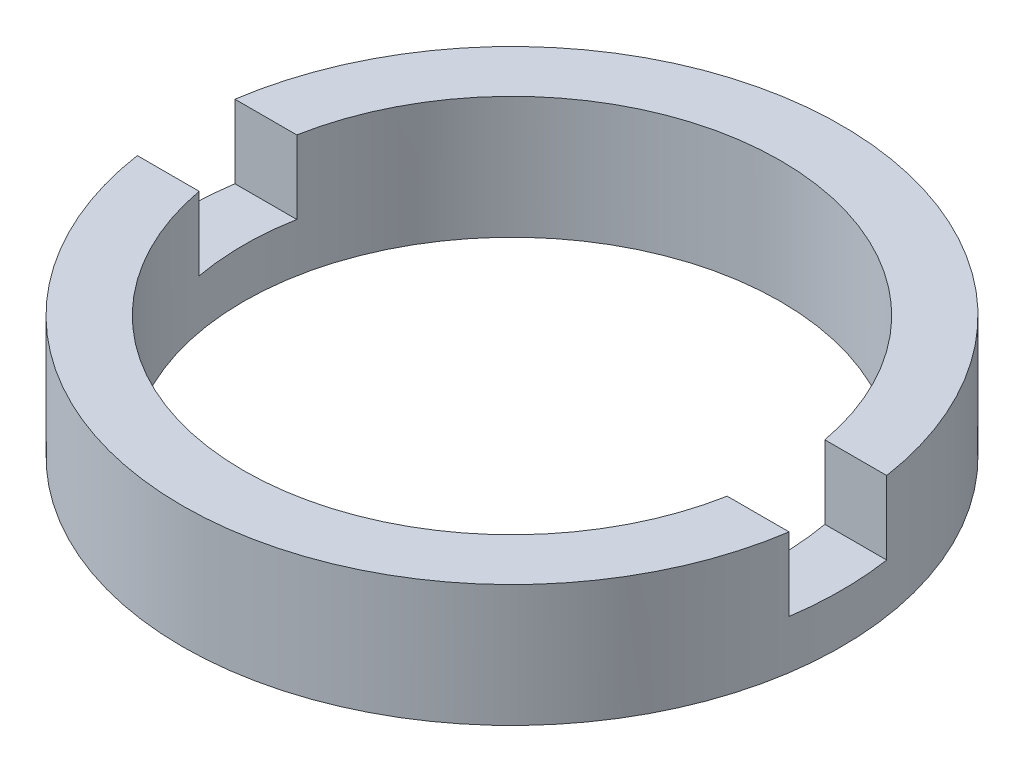
ISO-10303-21;
HEADER;
FILE_DESCRIPTION(('STEP AP214'),'2;1');
FILE_NAME('part.step','',(''),(''),'','','');
FILE_SCHEMA(('AUTOMOTIVE_DESIGN { 1 0 10303 214 1 1 1 1 }'));
ENDSEC;
DATA;
#1=APPLICATION_CONTEXT('core data for automotive mechanical design processes');
#2=APPLICATION_PROTOCOL_DEFINITION('international standard','automotive_design',2000,#1);
#3=PRODUCT_CONTEXT('',#1,'mechanical');
#4=PRODUCT('Part','Part','',(#3));
#5=PRODUCT_RELATED_PRODUCT_CATEGORY('part','',(#4));
#6=PRODUCT_DEFINITION_FORMATION('','',#4);
#7=PRODUCT_DEFINITION_CONTEXT('part definition',#1,'design');
#8=PRODUCT_DEFINITION('design','',#6,#7);
#9=PRODUCT_DEFINITION_SHAPE('','',#8);
#10=(LENGTH_UNIT() NAMED_UNIT(*) SI_UNIT(.MILLI.,.METRE.));
#11=(NAMED_UNIT(*) PLANE_ANGLE_UNIT() SI_UNIT($,.RADIAN.));
#12=(NAMED_UNIT(*) SI_UNIT($,.STERADIAN.) SOLID_ANGLE_UNIT());
#13=UNCERTAINTY_MEASURE_WITH_UNIT(LENGTH_MEASURE(1.E-05),#10,'distance_accuracy_value','');
#14=(GEOMETRIC_REPRESENTATION_CONTEXT(3) GLOBAL_UNCERTAINTY_ASSIGNED_CONTEXT((#13)) GLOBAL_UNIT_ASSIGNED_CONTEXT((#10,
#11,#12)) REPRESENTATION_CONTEXT('',''));
#15=CARTESIAN_POINT('',(0.,0.,0.));
#16=DIRECTION('',(0.,0.,1.));
#17=DIRECTION('',(1.,0.,0.));
#18=AXIS2_PLACEMENT_3D('',#15,#16,#17);
#19=CARTESIAN_POINT('',(5.50000000000001,-1.96424978717943,0.));
#20=DIRECTION('',(0.,-1.,0.));
#21=DIRECTION('',(0.,0.,-1.));
#22=AXIS2_PLACEMENT_3D('',#19,#20,#21);
#23=PLANE('',#22);
#24=CARTESIAN_POINT('',(0.,-1.96424978717943,0.));
#25=DIRECTION('',(0.,1.,0.));
#26=DIRECTION('',(0.,0.,1.));
#27=AXIS2_PLACEMENT_3D('',#24,#25,#26);
#28=CIRCLE('',#27,6.75000000000001);
#29=CARTESIAN_POINT('',(-6.67551496140936,-1.96424978717943,1.));
#30=VERTEX_POINT('',#29);
#31=CARTESIAN_POINT('',(6.67551496140933,-1.96424978717943,1.));
#32=VERTEX_POINT('',#31);
#33=EDGE_CURVE('E127',#30,#32,#28,.T.);
#34=ORIENTED_EDGE('',*,*,#33,.T.);
#35=DIRECTION('',(1.,0.,0.));
#36=VECTOR('',#35,1.);
#37=CARTESIAN_POINT('',(-26.8525402726146,-1.96424978717943,1.));
#38=LINE('',#37,#36);
#39=CARTESIAN_POINT('',(5.40832691319599,-1.96424978717943,1.));
#40=VERTEX_POINT('',#39);
#41=EDGE_CURVE('E120',#40,#32,#38,.T.);
#42=ORIENTED_EDGE('',*,*,#41,.F.);
#43=CARTESIAN_POINT('',(0.,-1.96424978717943,0.));
#44=DIRECTION('',(0.,1.,0.));
#45=DIRECTION('',(0.,0.,1.));
#46=AXIS2_PLACEMENT_3D('',#43,#44,#45);
#47=CIRCLE('',#46,5.50000000000001);
#48=CARTESIAN_POINT('',(-5.40832691319599,-1.96424978717943,1.));
#49=VERTEX_POINT('',#48);
#50=EDGE_CURVE('E134',#49,#40,#47,.T.);
#51=ORIENTED_EDGE('',*,*,#50,.F.);
#52=EDGE_CURVE('E149',#30,#49,#38,.T.);
#53=ORIENTED_EDGE('',*,*,#52,.F.);
#54=EDGE_LOOP('',(#34,#42,#51,#53));
#55=FACE_BOUND('',#54,.T.);
#56=ADVANCED_FACE('F37',(#55),#23,.F.);
#57=CARTESIAN_POINT('',(0.,56.2608426270136,0.));
#58=DIRECTION('',(0.,1.,0.));
#59=DIRECTION('',(0.,0.,1.));
#60=AXIS2_PLACEMENT_3D('',#57,#58,#59);
#61=CYLINDRICAL_SURFACE('',#60,6.75000000000001);
#62=CARTESIAN_POINT('',(0.,-3.46424978717943,0.));
#63=DIRECTION('',(0.,1.,0.));
#64=DIRECTION('',(0.,0.,1.));
#65=AXIS2_PLACEMENT_3D('',#62,#63,#64);
#66=CIRCLE('',#65,6.75000000000001);
#67=CARTESIAN_POINT('',(6.67551496140935,-3.46424978717943,1.));
#68=VERTEX_POINT('',#67);
#69=CARTESIAN_POINT('',(6.67551496140935,-3.46424978717943,-1.));
#70=VERTEX_POINT('',#69);
#71=EDGE_CURVE('E110',#68,#70,#66,.T.);
#72=ORIENTED_EDGE('',*,*,#71,.F.);
#73=DIRECTION('',(0.,1.,0.));
#74=VECTOR('',#73,1.);
#75=CARTESIAN_POINT('',(6.67551496140935,56.2608426270136,1.));
#76=LINE('',#75,#74);
#77=EDGE_CURVE('E162',#68,#32,#76,.T.);
#78=ORIENTED_EDGE('',*,*,#77,.T.);
#79=ORIENTED_EDGE('',*,*,#33,.F.);
#80=DIRECTION('',(0.,1.,0.));
#81=VECTOR('',#80,1.);
#82=CARTESIAN_POINT('',(-6.67551496140935,56.2608426270136,1.));
#83=LINE('',#82,#81);
#84=CARTESIAN_POINT('',(-6.67551496140935,-3.46424978717943,1.));
#85=VERTEX_POINT('',#84);
#86=EDGE_CURVE('E159',#30,#85,#83,.F.);
#87=ORIENTED_EDGE('',*,*,#86,.T.);
#88=CARTESIAN_POINT('',(-6.67551496140935,-3.46424978717943,-1.));
#89=VERTEX_POINT('',#88);
#90=EDGE_CURVE('E156',#89,#85,#66,.T.);
#91=ORIENTED_EDGE('',*,*,#90,.F.);
#92=DIRECTION('',(0.,1.,0.));
#93=VECTOR('',#92,1.);
#94=CARTESIAN_POINT('',(-6.67551496140935,56.2608426270136,-1.));
#95=LINE('',#94,#93);
#96=CARTESIAN_POINT('',(-6.67551496140936,-1.96424978717943,-1.));
#97=VERTEX_POINT('',#96);
#98=EDGE_CURVE('E109',#89,#97,#95,.T.);
#99=ORIENTED_EDGE('',*,*,#98,.T.);
#100=CARTESIAN_POINT('',(6.67551496140933,-1.96424978717943,-1.));
#101=VERTEX_POINT('',#100);
#102=EDGE_CURVE('E117',#101,#97,#28,.T.);
#103=ORIENTED_EDGE('',*,*,#102,.F.);
#104=DIRECTION('',(0.,1.,0.));
#105=VECTOR('',#104,1.);
#106=CARTESIAN_POINT('',(6.67551496140935,56.2608426270136,-1.));
#107=LINE('',#106,#105);
#108=EDGE_CURVE('E101',#101,#70,#107,.F.);
#109=ORIENTED_EDGE('',*,*,#108,.T.);
#110=EDGE_LOOP('',(#72,#78,#79,#87,#91,#99,#103,#109));
#111=FACE_BOUND('',#110,.T.);
#112=CARTESIAN_POINT('',(0.,-4.46424978717943,0.));
#113=DIRECTION('',(0.,1.,0.));
#114=DIRECTION('',(0.,0.,1.));
#115=AXIS2_PLACEMENT_3D('',#112,#113,#114);
#116=CIRCLE('',#115,6.75000000000001);
#117=CARTESIAN_POINT('',(0.,-4.46424978717943,6.75000000000001));
#118=VERTEX_POINT('',#117);
#119=EDGE_CURVE('E165',#118,#118,#116,.T.);
#120=ORIENTED_EDGE('',*,*,#119,.T.);
#121=EDGE_LOOP('',(#120));
#122=FACE_BOUND('',#121,.T.);
#123=ADVANCED_FACE('F39',(#111,#122),#61,.T.);
#124=ORIENTED_EDGE('',*,*,#102,.T.);
#125=DIRECTION('',(-1.,0.,0.));
#126=VECTOR('',#125,1.);
#127=CARTESIAN_POINT('',(-26.8525402726146,-1.96424978717943,-1.));
#128=LINE('',#127,#126);
#129=CARTESIAN_POINT('',(-5.40832691319599,-1.96424978717943,-1.));
#130=VERTEX_POINT('',#129);
#131=EDGE_CURVE('E121',#130,#97,#128,.T.);
#132=ORIENTED_EDGE('',*,*,#131,.F.);
#133=CARTESIAN_POINT('',(5.40832691319599,-1.96424978717943,-1.));
#134=VERTEX_POINT('',#133);
#135=EDGE_CURVE('E119',#134,#130,#47,.T.);
#136=ORIENTED_EDGE('',*,*,#135,.F.);
#137=EDGE_CURVE('E104',#101,#134,#128,.T.);
#138=ORIENTED_EDGE('',*,*,#137,.F.);
#139=EDGE_LOOP('',(#124,#132,#136,#138));
#140=FACE_BOUND('',#139,.T.);
#141=ADVANCED_FACE('F115',(#140),#23,.F.);
#142=CARTESIAN_POINT('',(0.,56.2608426270136,0.));
#143=DIRECTION('',(0.,1.,0.));
#144=DIRECTION('',(0.,0.,1.));
#145=AXIS2_PLACEMENT_3D('',#142,#143,#144);
#146=CYLINDRICAL_SURFACE('',#145,5.50000000000001);
#147=CARTESIAN_POINT('',(0.,-3.46424978717943,0.));
#148=DIRECTION('',(0.,1.,0.));
#149=DIRECTION('',(0.,0.,1.));
#150=AXIS2_PLACEMENT_3D('',#147,#148,#149);
#151=CIRCLE('',#150,5.50000000000001);
#152=CARTESIAN_POINT('',(-5.40832691319599,-3.46424978717943,1.));
#153=VERTEX_POINT('',#152);
#154=CARTESIAN_POINT('',(-5.40832691319599,-3.46424978717943,-1.));
#155=VERTEX_POINT('',#154);
#156=EDGE_CURVE('E131',#153,#155,#151,.F.);
#157=ORIENTED_EDGE('',*,*,#156,.F.);
#158=DIRECTION('',(0.,1.,0.));
#159=VECTOR('',#158,1.);
#160=CARTESIAN_POINT('',(-5.40832691319599,56.2608426270136,1.));
#161=LINE('',#160,#159);
#162=EDGE_CURVE('E11',#153,#49,#161,.T.);
#163=ORIENTED_EDGE('',*,*,#162,.T.);
#164=ORIENTED_EDGE('',*,*,#50,.T.);
#165=DIRECTION('',(0.,1.,0.));
#166=VECTOR('',#165,1.);
#167=CARTESIAN_POINT('',(5.40832691319599,56.2608426270136,1.));
#168=LINE('',#167,#166);
#169=CARTESIAN_POINT('',(5.40832691319599,-3.46424978717943,1.));
#170=VERTEX_POINT('',#169);
#171=EDGE_CURVE('E138',#40,#170,#168,.F.);
#172=ORIENTED_EDGE('',*,*,#171,.T.);
#173=CARTESIAN_POINT('',(5.40832691319599,-3.46424978717943,-1.));
#174=VERTEX_POINT('',#173);
#175=EDGE_CURVE('E126',#174,#170,#151,.F.);
#176=ORIENTED_EDGE('',*,*,#175,.F.);
#177=DIRECTION('',(0.,1.,0.));
#178=VECTOR('',#177,1.);
#179=CARTESIAN_POINT('',(5.40832691319599,56.2608426270136,-1.));
#180=LINE('',#179,#178);
#181=EDGE_CURVE('E129',#174,#134,#180,.T.);
#182=ORIENTED_EDGE('',*,*,#181,.T.);
#183=ORIENTED_EDGE('',*,*,#135,.T.);
#184=DIRECTION('',(0.,1.,0.));
#185=VECTOR('',#184,1.);
#186=CARTESIAN_POINT('',(-5.40832691319599,56.2608426270136,-1.));
#187=LINE('',#186,#185);
#188=EDGE_CURVE('E45',#130,#155,#187,.F.);
#189=ORIENTED_EDGE('',*,*,#188,.T.);
#190=EDGE_LOOP('',(#157,#163,#164,#172,#176,#182,#183,#189));
#191=FACE_BOUND('',#190,.T.);
#192=CARTESIAN_POINT('',(0.,-4.46424978717943,0.));
#193=DIRECTION('',(0.,1.,0.));
#194=DIRECTION('',(0.,0.,1.));
#195=AXIS2_PLACEMENT_3D('',#192,#193,#194);
#196=CIRCLE('',#195,5.50000000000001);
#197=CARTESIAN_POINT('',(0.,-4.46424978717943,5.50000000000001));
#198=VERTEX_POINT('',#197);
#199=EDGE_CURVE('E167',#198,#198,#196,.T.);
#200=ORIENTED_EDGE('',*,*,#199,.F.);
#201=EDGE_LOOP('',(#200));
#202=FACE_BOUND('',#201,.T.);
#203=ADVANCED_FACE('F173',(#191,#202),#146,.F.);
#204=CARTESIAN_POINT('',(5.50000000000001,-4.46424978717943,0.));
#205=DIRECTION('',(0.,1.,0.));
#206=DIRECTION('',(0.,0.,1.));
#207=AXIS2_PLACEMENT_3D('',#204,#205,#206);
#208=PLANE('',#207);
#209=ORIENTED_EDGE('',*,*,#119,.F.);
#210=EDGE_LOOP('',(#209));
#211=FACE_BOUND('',#210,.T.);
#212=ORIENTED_EDGE('',*,*,#199,.T.);
#213=EDGE_LOOP('',(#212));
#214=FACE_BOUND('',#213,.T.);
#215=ADVANCED_FACE('F203',(#211,#214),#208,.F.);
#216=CARTESIAN_POINT('',(0.,-3.46424978717943,0.));
#217=DIRECTION('',(0.,1.,0.));
#218=DIRECTION('',(0.,0.,1.));
#219=AXIS2_PLACEMENT_3D('',#216,#217,#218);
#220=PLANE('',#219);
#221=ORIENTED_EDGE('',*,*,#71,.T.);
#222=DIRECTION('',(-1.,0.,0.));
#223=VECTOR('',#222,1.);
#224=CARTESIAN_POINT('',(-26.8525402726146,-3.46424978717943,-1.));
#225=LINE('',#224,#223);
#226=EDGE_CURVE('E60',#70,#174,#225,.T.);
#227=ORIENTED_EDGE('',*,*,#226,.T.);
#228=ORIENTED_EDGE('',*,*,#175,.T.);
#229=DIRECTION('',(1.,0.,0.));
#230=VECTOR('',#229,1.);
#231=CARTESIAN_POINT('',(-26.8525402726146,-3.46424978717943,1.));
#232=LINE('',#231,#230);
#233=EDGE_CURVE('E151',#170,#68,#232,.T.);
#234=ORIENTED_EDGE('',*,*,#233,.T.);
#235=EDGE_LOOP('',(#221,#227,#228,#234));
#236=FACE_BOUND('',#235,.T.);
#237=ADVANCED_FACE('F177',(#236),#220,.T.);
#238=CARTESIAN_POINT('',(-26.8525402726146,-3.46424978717943,-1.));
#239=DIRECTION('',(0.,0.,-1.));
#240=DIRECTION('',(-1.,0.,0.));
#241=AXIS2_PLACEMENT_3D('',#238,#239,#240);
#242=PLANE('',#241);
#243=ORIENTED_EDGE('',*,*,#137,.T.);
#244=ORIENTED_EDGE('',*,*,#181,.F.);
#245=ORIENTED_EDGE('',*,*,#226,.F.);
#246=ORIENTED_EDGE('',*,*,#108,.F.);
#247=EDGE_LOOP('',(#243,#244,#245,#246));
#248=FACE_BOUND('',#247,.T.);
#249=ADVANCED_FACE('F103',(#248),#242,.F.);
#250=CARTESIAN_POINT('',(-26.8525402726146,-3.46424978717943,1.));
#251=DIRECTION('',(0.,0.,1.));
#252=DIRECTION('',(1.,0.,0.));
#253=AXIS2_PLACEMENT_3D('',#250,#251,#252);
#254=PLANE('',#253);
#255=ORIENTED_EDGE('',*,*,#233,.F.);
#256=ORIENTED_EDGE('',*,*,#171,.F.);
#257=ORIENTED_EDGE('',*,*,#41,.T.);
#258=ORIENTED_EDGE('',*,*,#77,.F.);
#259=EDGE_LOOP('',(#255,#256,#257,#258));
#260=FACE_BOUND('',#259,.T.);
#261=ADVANCED_FACE('F179',(#260),#254,.F.);
#262=ORIENTED_EDGE('',*,*,#52,.T.);
#263=ORIENTED_EDGE('',*,*,#162,.F.);
#264=EDGE_CURVE('E52',#85,#153,#232,.T.);
#265=ORIENTED_EDGE('',*,*,#264,.F.);
#266=ORIENTED_EDGE('',*,*,#86,.F.);
#267=EDGE_LOOP('',(#262,#263,#265,#266));
#268=FACE_BOUND('',#267,.T.);
#269=ADVANCED_FACE('F185',(#268),#254,.F.);
#270=EDGE_CURVE('E146',#155,#89,#225,.T.);
#271=ORIENTED_EDGE('',*,*,#270,.F.);
#272=ORIENTED_EDGE('',*,*,#188,.F.);
#273=ORIENTED_EDGE('',*,*,#131,.T.);
#274=ORIENTED_EDGE('',*,*,#98,.F.);
#275=EDGE_LOOP('',(#271,#272,#273,#274));
#276=FACE_BOUND('',#275,.T.);
#277=ADVANCED_FACE('F148',(#276),#242,.F.);
#278=ORIENTED_EDGE('',*,*,#90,.T.);
#279=ORIENTED_EDGE('',*,*,#264,.T.);
#280=ORIENTED_EDGE('',*,*,#156,.T.);
#281=ORIENTED_EDGE('',*,*,#270,.T.);
#282=EDGE_LOOP('',(#278,#279,#280,#281));
#283=FACE_BOUND('',#282,.T.);
#284=ADVANCED_FACE('F145',(#283),#220,.T.);
#285=CLOSED_SHELL('',(#56,#123,#141,#203,#215,#237,#249,#261,#269,#277,#284));
#286=MANIFOLD_SOLID_BREP('B2',#285);
#287=ADVANCED_BREP_SHAPE_REPRESENTATION('',(#18,#286),#14);
#288=SHAPE_DEFINITION_REPRESENTATION(#9,#287);
ENDSEC;
END-ISO-10303-21;
